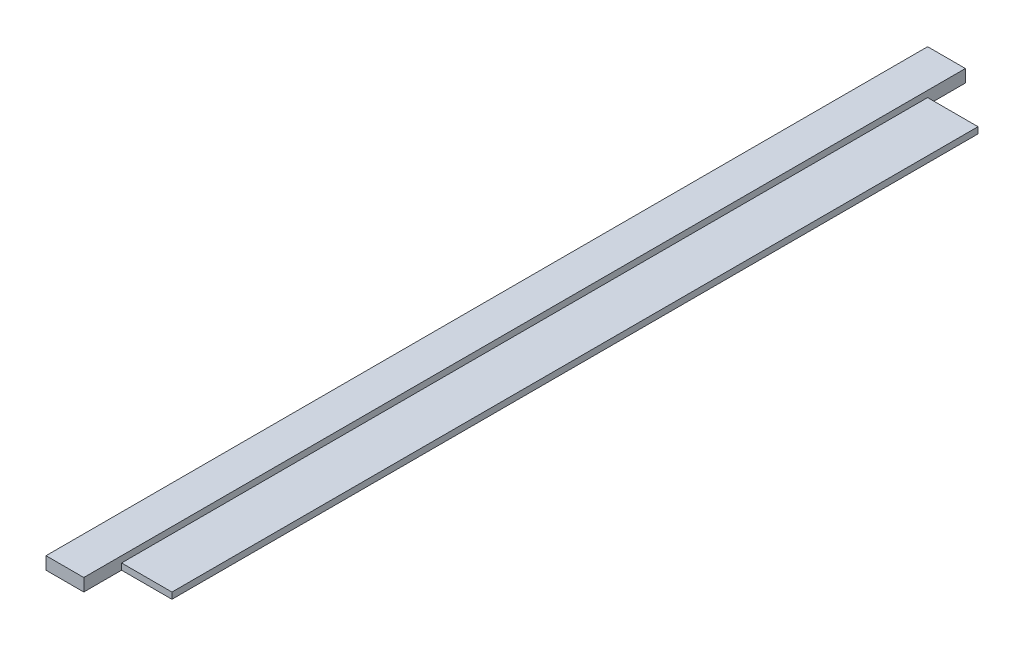
ISO-10303-21;
HEADER;
FILE_DESCRIPTION(('STEP AP214'),'2;1');
FILE_NAME('part.step','',(''),(''),'','','');
FILE_SCHEMA(('AUTOMOTIVE_DESIGN { 1 0 10303 214 1 1 1 1 }'));
ENDSEC;
DATA;
#1=APPLICATION_CONTEXT('core data for automotive mechanical design processes');
#2=APPLICATION_PROTOCOL_DEFINITION('international standard','automotive_design',2000,#1);
#3=PRODUCT_CONTEXT('',#1,'mechanical');
#4=PRODUCT('Part','Part','',(#3));
#5=PRODUCT_RELATED_PRODUCT_CATEGORY('part','',(#4));
#6=PRODUCT_DEFINITION_FORMATION('','',#4);
#7=PRODUCT_DEFINITION_CONTEXT('part definition',#1,'design');
#8=PRODUCT_DEFINITION('design','',#6,#7);
#9=PRODUCT_DEFINITION_SHAPE('','',#8);
#10=(LENGTH_UNIT() NAMED_UNIT(*) SI_UNIT(.MILLI.,.METRE.));
#11=(NAMED_UNIT(*) PLANE_ANGLE_UNIT() SI_UNIT($,.RADIAN.));
#12=(NAMED_UNIT(*) SI_UNIT($,.STERADIAN.) SOLID_ANGLE_UNIT());
#13=UNCERTAINTY_MEASURE_WITH_UNIT(LENGTH_MEASURE(1.E-05),#10,'distance_accuracy_value','');
#14=(GEOMETRIC_REPRESENTATION_CONTEXT(3) GLOBAL_UNCERTAINTY_ASSIGNED_CONTEXT((#13)) GLOBAL_UNIT_ASSIGNED_CONTEXT((#10,
#11,#12)) REPRESENTATION_CONTEXT('',''));
#15=CARTESIAN_POINT('',(0.,0.,0.));
#16=DIRECTION('',(0.,0.,1.));
#17=DIRECTION('',(1.,0.,0.));
#18=AXIS2_PLACEMENT_3D('',#15,#16,#17);
#19=CARTESIAN_POINT('',(0.,1.,0.));
#20=DIRECTION('',(0.,0.,1.));
#21=DIRECTION('',(1.,0.,0.));
#22=AXIS2_PLACEMENT_3D('',#19,#20,#21);
#23=PLANE('',#22);
#24=DIRECTION('',(0.,-1.,0.));
#25=VECTOR('',#24,1.);
#26=CARTESIAN_POINT('',(3.,1.,0.));
#27=LINE('',#26,#25);
#28=CARTESIAN_POINT('',(3.,0.5,0.));
#29=VERTEX_POINT('',#28);
#30=CARTESIAN_POINT('',(3.,0.,0.));
#31=VERTEX_POINT('',#30);
#32=EDGE_CURVE('E11',#29,#31,#27,.T.);
#33=ORIENTED_EDGE('',*,*,#32,.F.);
#34=DIRECTION('',(-1.,0.,0.));
#35=VECTOR('',#34,1.);
#36=CARTESIAN_POINT('',(3.,0.5,0.));
#37=LINE('',#36,#35);
#38=CARTESIAN_POINT('',(7.00000000000001,0.499999999999862,0.));
#39=VERTEX_POINT('',#38);
#40=EDGE_CURVE('E116',#39,#29,#37,.T.);
#41=ORIENTED_EDGE('',*,*,#40,.F.);
#42=DIRECTION('',(0.,1.,0.));
#43=VECTOR('',#42,1.);
#44=CARTESIAN_POINT('',(7.00000000000001,0.499999999999862,0.));
#45=LINE('',#44,#43);
#46=CARTESIAN_POINT('',(7.00000000000001,-1.38777878078145E-13,0.));
#47=VERTEX_POINT('',#46);
#48=EDGE_CURVE('E117',#47,#39,#45,.T.);
#49=ORIENTED_EDGE('',*,*,#48,.F.);
#50=DIRECTION('',(1.,0.,0.));
#51=VECTOR('',#50,1.);
#52=CARTESIAN_POINT('',(0.,0.,0.));
#53=LINE('',#52,#51);
#54=EDGE_CURVE('E122',#31,#47,#53,.T.);
#55=ORIENTED_EDGE('',*,*,#54,.F.);
#56=EDGE_LOOP('',(#33,#41,#49,#55));
#57=FACE_BOUND('',#56,.T.);
#58=ADVANCED_FACE('F16',(#57),#23,.F.);
#59=CARTESIAN_POINT('',(-6.93889390390723E-13,-2.22044604925031E-13,64.));
#60=DIRECTION('',(1.,0.,0.));
#61=DIRECTION('',(0.,0.,-1.));
#62=AXIS2_PLACEMENT_3D('',#59,#60,#61);
#63=PLANE('',#62);
#64=DIRECTION('',(0.,0.,-1.));
#65=VECTOR('',#64,1.);
#66=CARTESIAN_POINT('',(-6.45317133063372E-13,0.999999999999779,64.));
#67=LINE('',#66,#65);
#68=CARTESIAN_POINT('',(-5.82867087928207E-13,0.999999999999779,67.));
#69=VERTEX_POINT('',#68);
#70=CARTESIAN_POINT('',(0.,1.,-3.));
#71=VERTEX_POINT('',#70);
#72=EDGE_CURVE('E133',#69,#71,#67,.T.);
#73=ORIENTED_EDGE('',*,*,#72,.T.);
#74=DIRECTION('',(0.,1.,0.));
#75=VECTOR('',#74,1.);
#76=CARTESIAN_POINT('',(0.,1.,-3.));
#77=LINE('',#76,#75);
#78=CARTESIAN_POINT('',(0.,0.,-3.));
#79=VERTEX_POINT('',#78);
#80=EDGE_CURVE('E96',#79,#71,#77,.T.);
#81=ORIENTED_EDGE('',*,*,#80,.F.);
#82=DIRECTION('',(0.,0.,-1.));
#83=VECTOR('',#82,1.);
#84=CARTESIAN_POINT('',(-6.93889390390723E-13,-2.22044604925031E-13,64.));
#85=LINE('',#84,#83);
#86=CARTESIAN_POINT('',(-6.93889390390723E-13,-2.22044604925031E-13,67.));
#87=VERTEX_POINT('',#86);
#88=EDGE_CURVE('E25',#87,#79,#85,.T.);
#89=ORIENTED_EDGE('',*,*,#88,.F.);
#90=DIRECTION('',(0.,-1.,0.));
#91=VECTOR('',#90,1.);
#92=CARTESIAN_POINT('',(-6.93889390390723E-13,-2.22044604925031E-13,67.));
#93=LINE('',#92,#91);
#94=EDGE_CURVE('E109',#69,#87,#93,.T.);
#95=ORIENTED_EDGE('',*,*,#94,.F.);
#96=EDGE_LOOP('',(#73,#81,#89,#95));
#97=FACE_BOUND('',#96,.T.);
#98=ADVANCED_FACE('F18',(#97),#63,.F.);
#99=CARTESIAN_POINT('',(-6.93889390390723E-13,-2.22044604925031E-13,64.));
#100=DIRECTION('',(0.,1.,0.));
#101=DIRECTION('',(0.,0.,1.));
#102=AXIS2_PLACEMENT_3D('',#99,#100,#101);
#103=PLANE('',#102);
#104=ORIENTED_EDGE('',*,*,#88,.T.);
#105=DIRECTION('',(-1.,0.,0.));
#106=VECTOR('',#105,1.);
#107=CARTESIAN_POINT('',(3.00000000000006,0.,-3.));
#108=LINE('',#107,#106);
#109=CARTESIAN_POINT('',(3.00000000000006,0.,-3.));
#110=VERTEX_POINT('',#109);
#111=EDGE_CURVE('E87',#110,#79,#108,.T.);
#112=ORIENTED_EDGE('',*,*,#111,.F.);
#113=DIRECTION('',(0.,0.,1.));
#114=VECTOR('',#113,1.);
#115=CARTESIAN_POINT('',(3.00000000000006,0.,-3.));
#116=LINE('',#115,#114);
#117=EDGE_CURVE('E91',#110,#31,#116,.T.);
#118=ORIENTED_EDGE('',*,*,#117,.T.);
#119=ORIENTED_EDGE('',*,*,#54,.T.);
#120=DIRECTION('',(0.,0.,-1.));
#121=VECTOR('',#120,1.);
#122=CARTESIAN_POINT('',(6.99999999999919,-1.66533453693773E-13,64.));
#123=LINE('',#122,#121);
#124=CARTESIAN_POINT('',(6.99999999999919,-1.66533453693773E-13,64.));
#125=VERTEX_POINT('',#124);
#126=EDGE_CURVE('E140',#125,#47,#123,.T.);
#127=ORIENTED_EDGE('',*,*,#126,.F.);
#128=DIRECTION('',(1.,0.,0.));
#129=VECTOR('',#128,1.);
#130=CARTESIAN_POINT('',(-6.93889390390723E-13,-2.22044604925031E-13,64.));
#131=LINE('',#130,#129);
#132=CARTESIAN_POINT('',(2.99999999999919,-1.11022302462516E-13,64.));
#133=VERTEX_POINT('',#132);
#134=EDGE_CURVE('E57',#133,#125,#131,.T.);
#135=ORIENTED_EDGE('',*,*,#134,.F.);
#136=DIRECTION('',(0.,0.,-1.));
#137=VECTOR('',#136,1.);
#138=CARTESIAN_POINT('',(2.99999999999931,-1.11022302462516E-13,67.));
#139=LINE('',#138,#137);
#140=CARTESIAN_POINT('',(2.99999999999931,-1.11022302462516E-13,67.));
#141=VERTEX_POINT('',#140);
#142=EDGE_CURVE('E128',#141,#133,#139,.T.);
#143=ORIENTED_EDGE('',*,*,#142,.F.);
#144=DIRECTION('',(1.,0.,0.));
#145=VECTOR('',#144,1.);
#146=CARTESIAN_POINT('',(-6.93889390390723E-13,-2.22044604925031E-13,67.));
#147=LINE('',#146,#145);
#148=EDGE_CURVE('E170',#87,#141,#147,.T.);
#149=ORIENTED_EDGE('',*,*,#148,.F.);
#150=EDGE_LOOP('',(#104,#112,#118,#119,#127,#135,#143,#149));
#151=FACE_BOUND('',#150,.T.);
#152=ADVANCED_FACE('F89',(#151),#103,.F.);
#153=CARTESIAN_POINT('',(6.99999999999919,0.499999999999834,64.));
#154=DIRECTION('',(-1.,0.,0.));
#155=DIRECTION('',(0.,0.,1.));
#156=AXIS2_PLACEMENT_3D('',#153,#154,#155);
#157=PLANE('',#156);
#158=ORIENTED_EDGE('',*,*,#48,.T.);
#159=DIRECTION('',(0.,0.,-1.));
#160=VECTOR('',#159,1.);
#161=CARTESIAN_POINT('',(6.99999999999919,0.499999999999834,64.));
#162=LINE('',#161,#160);
#163=CARTESIAN_POINT('',(6.99999999999919,0.499999999999834,64.));
#164=VERTEX_POINT('',#163);
#165=EDGE_CURVE('E138',#164,#39,#162,.T.);
#166=ORIENTED_EDGE('',*,*,#165,.F.);
#167=DIRECTION('',(0.,1.,0.));
#168=VECTOR('',#167,1.);
#169=CARTESIAN_POINT('',(6.99999999999919,0.499999999999834,64.));
#170=LINE('',#169,#168);
#171=EDGE_CURVE('E120',#125,#164,#170,.T.);
#172=ORIENTED_EDGE('',*,*,#171,.F.);
#173=ORIENTED_EDGE('',*,*,#126,.T.);
#174=EDGE_LOOP('',(#158,#166,#172,#173));
#175=FACE_BOUND('',#174,.T.);
#176=ADVANCED_FACE('F149',(#175),#157,.F.);
#177=CARTESIAN_POINT('',(2.99999999999919,0.499999999999889,64.));
#178=DIRECTION('',(0.,-1.,0.));
#179=DIRECTION('',(0.,0.,-1.));
#180=AXIS2_PLACEMENT_3D('',#177,#178,#179);
#181=PLANE('',#180);
#182=ORIENTED_EDGE('',*,*,#40,.T.);
#183=DIRECTION('',(0.,0.,-1.));
#184=VECTOR('',#183,1.);
#185=CARTESIAN_POINT('',(2.99999999999919,0.499999999999889,64.));
#186=LINE('',#185,#184);
#187=CARTESIAN_POINT('',(2.99999999999919,0.499999999999889,64.));
#188=VERTEX_POINT('',#187);
#189=EDGE_CURVE('E137',#188,#29,#186,.T.);
#190=ORIENTED_EDGE('',*,*,#189,.F.);
#191=DIRECTION('',(-1.,0.,0.));
#192=VECTOR('',#191,1.);
#193=CARTESIAN_POINT('',(2.99999999999919,0.499999999999889,64.));
#194=LINE('',#193,#192);
#195=EDGE_CURVE('E39',#164,#188,#194,.T.);
#196=ORIENTED_EDGE('',*,*,#195,.F.);
#197=ORIENTED_EDGE('',*,*,#165,.T.);
#198=EDGE_LOOP('',(#182,#190,#196,#197));
#199=FACE_BOUND('',#198,.T.);
#200=ADVANCED_FACE('F150',(#199),#181,.F.);
#201=CARTESIAN_POINT('',(2.99999999999919,0.499999999999889,64.));
#202=DIRECTION('',(-1.,0.,0.));
#203=DIRECTION('',(0.,0.,1.));
#204=AXIS2_PLACEMENT_3D('',#201,#202,#203);
#205=PLANE('',#204);
#206=ORIENTED_EDGE('',*,*,#189,.T.);
#207=ORIENTED_EDGE('',*,*,#32,.T.);
#208=ORIENTED_EDGE('',*,*,#117,.F.);
#209=DIRECTION('',(0.,-1.,0.));
#210=VECTOR('',#209,1.);
#211=CARTESIAN_POINT('',(3.,1.,-3.));
#212=LINE('',#211,#210);
#213=CARTESIAN_POINT('',(3.,1.,-3.));
#214=VERTEX_POINT('',#213);
#215=EDGE_CURVE('E97',#214,#110,#212,.T.);
#216=ORIENTED_EDGE('',*,*,#215,.F.);
#217=DIRECTION('',(0.,0.,-1.));
#218=VECTOR('',#217,1.);
#219=CARTESIAN_POINT('',(2.99999999999919,0.99999999999989,64.));
#220=LINE('',#219,#218);
#221=CARTESIAN_POINT('',(2.99999999999931,0.999999999999834,67.));
#222=VERTEX_POINT('',#221);
#223=EDGE_CURVE('E135',#222,#214,#220,.T.);
#224=ORIENTED_EDGE('',*,*,#223,.F.);
#225=DIRECTION('',(0.,1.,0.));
#226=VECTOR('',#225,1.);
#227=CARTESIAN_POINT('',(2.99999999999931,-1.11022302462516E-13,67.));
#228=LINE('',#227,#226);
#229=EDGE_CURVE('E156',#141,#222,#228,.T.);
#230=ORIENTED_EDGE('',*,*,#229,.F.);
#231=ORIENTED_EDGE('',*,*,#142,.T.);
#232=DIRECTION('',(0.,1.,0.));
#233=VECTOR('',#232,1.);
#234=CARTESIAN_POINT('',(2.99999999999919,-1.11022302462516E-13,64.));
#235=LINE('',#234,#233);
#236=EDGE_CURVE('E33',#133,#188,#235,.T.);
#237=ORIENTED_EDGE('',*,*,#236,.T.);
#238=EDGE_LOOP('',(#206,#207,#208,#216,#224,#230,#231,#237));
#239=FACE_BOUND('',#238,.T.);
#240=ADVANCED_FACE('F107',(#239),#205,.F.);
#241=CARTESIAN_POINT('',(2.99999999999919,0.99999999999989,64.));
#242=DIRECTION('',(0.,-1.,0.));
#243=DIRECTION('',(1.,0.,0.));
#244=AXIS2_PLACEMENT_3D('',#241,#242,#243);
#245=PLANE('',#244);
#246=ORIENTED_EDGE('',*,*,#223,.T.);
#247=DIRECTION('',(1.,0.,0.));
#248=VECTOR('',#247,1.);
#249=CARTESIAN_POINT('',(3.,1.,-3.));
#250=LINE('',#249,#248);
#251=EDGE_CURVE('E103',#71,#214,#250,.T.);
#252=ORIENTED_EDGE('',*,*,#251,.F.);
#253=ORIENTED_EDGE('',*,*,#72,.F.);
#254=DIRECTION('',(-1.,0.,0.));
#255=VECTOR('',#254,1.);
#256=CARTESIAN_POINT('',(-5.82867087928207E-13,0.999999999999779,67.));
#257=LINE('',#256,#255);
#258=EDGE_CURVE('E157',#222,#69,#257,.T.);
#259=ORIENTED_EDGE('',*,*,#258,.F.);
#260=EDGE_LOOP('',(#246,#252,#253,#259));
#261=FACE_BOUND('',#260,.T.);
#262=ADVANCED_FACE('F179',(#261),#245,.F.);
#263=CARTESIAN_POINT('',(-6.45317133063372E-13,0.999999999999779,64.));
#264=DIRECTION('',(0.,0.,1.));
#265=DIRECTION('',(1.,0.,0.));
#266=AXIS2_PLACEMENT_3D('',#263,#264,#265);
#267=PLANE('',#266);
#268=ORIENTED_EDGE('',*,*,#236,.F.);
#269=ORIENTED_EDGE('',*,*,#134,.T.);
#270=ORIENTED_EDGE('',*,*,#171,.T.);
#271=ORIENTED_EDGE('',*,*,#195,.T.);
#272=EDGE_LOOP('',(#268,#269,#270,#271));
#273=FACE_BOUND('',#272,.T.);
#274=ADVANCED_FACE('F148',(#273),#267,.T.);
#275=CARTESIAN_POINT('',(-5.82867087928207E-13,0.999999999999779,67.));
#276=DIRECTION('',(0.,0.,-1.));
#277=DIRECTION('',(-1.,0.,0.));
#278=AXIS2_PLACEMENT_3D('',#275,#276,#277);
#279=PLANE('',#278);
#280=ORIENTED_EDGE('',*,*,#94,.T.);
#281=ORIENTED_EDGE('',*,*,#148,.T.);
#282=ORIENTED_EDGE('',*,*,#229,.T.);
#283=ORIENTED_EDGE('',*,*,#258,.T.);
#284=EDGE_LOOP('',(#280,#281,#282,#283));
#285=FACE_BOUND('',#284,.T.);
#286=ADVANCED_FACE('F180',(#285),#279,.F.);
#287=CARTESIAN_POINT('',(3.00000000000006,0.,-3.));
#288=DIRECTION('',(0.,0.,-1.));
#289=DIRECTION('',(-1.,0.,0.));
#290=AXIS2_PLACEMENT_3D('',#287,#288,#289);
#291=PLANE('',#290);
#292=ORIENTED_EDGE('',*,*,#215,.T.);
#293=ORIENTED_EDGE('',*,*,#111,.T.);
#294=ORIENTED_EDGE('',*,*,#80,.T.);
#295=ORIENTED_EDGE('',*,*,#251,.T.);
#296=EDGE_LOOP('',(#292,#293,#294,#295));
#297=FACE_BOUND('',#296,.T.);
#298=ADVANCED_FACE('F101',(#297),#291,.T.);
#299=CLOSED_SHELL('',(#58,#98,#152,#176,#200,#240,#262,#274,#286,#298));
#300=MANIFOLD_SOLID_BREP('B1',#299);
#301=ADVANCED_BREP_SHAPE_REPRESENTATION('',(#18,#300),#14);
#302=SHAPE_DEFINITION_REPRESENTATION(#9,#301);
ENDSEC;
END-ISO-10303-21;
